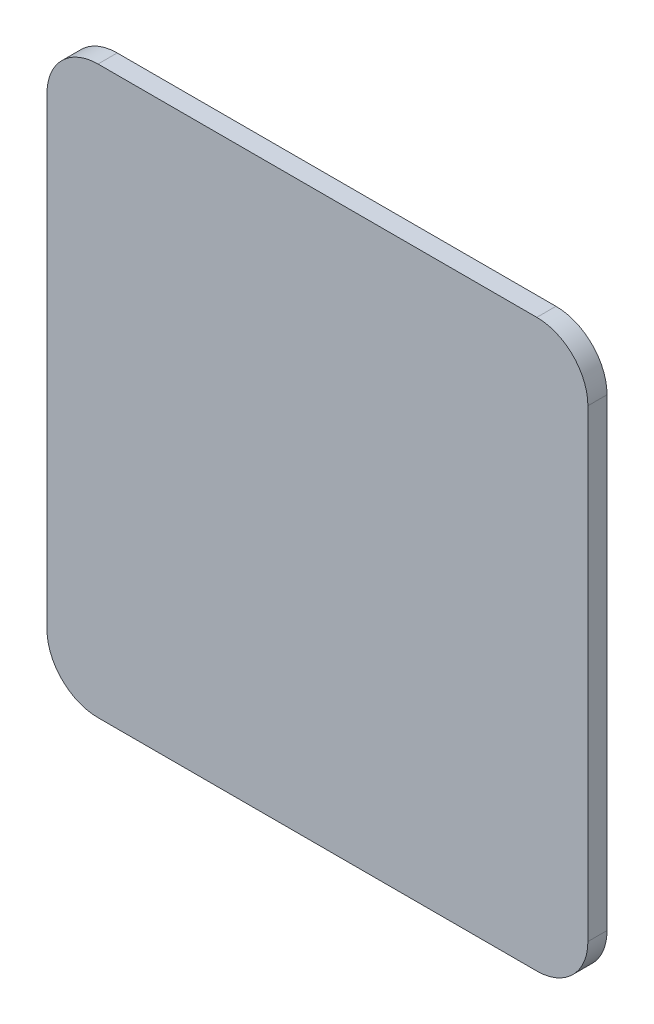
ISO-10303-21;
HEADER;
FILE_DESCRIPTION(('STEP AP214'),'2;1');
FILE_NAME('part.step','',(''),(''),'','','');
FILE_SCHEMA(('AUTOMOTIVE_DESIGN { 1 0 10303 214 1 1 1 1 }'));
ENDSEC;
DATA;
#1=APPLICATION_CONTEXT('core data for automotive mechanical design processes');
#2=APPLICATION_PROTOCOL_DEFINITION('international standard','automotive_design',2000,#1);
#3=PRODUCT_CONTEXT('',#1,'mechanical');
#4=PRODUCT('Part','Part','',(#3));
#5=PRODUCT_RELATED_PRODUCT_CATEGORY('part','',(#4));
#6=PRODUCT_DEFINITION_FORMATION('','',#4);
#7=PRODUCT_DEFINITION_CONTEXT('part definition',#1,'design');
#8=PRODUCT_DEFINITION('design','',#6,#7);
#9=PRODUCT_DEFINITION_SHAPE('','',#8);
#10=(LENGTH_UNIT() NAMED_UNIT(*) SI_UNIT(.MILLI.,.METRE.));
#11=(NAMED_UNIT(*) PLANE_ANGLE_UNIT() SI_UNIT($,.RADIAN.));
#12=(NAMED_UNIT(*) SI_UNIT($,.STERADIAN.) SOLID_ANGLE_UNIT());
#13=UNCERTAINTY_MEASURE_WITH_UNIT(LENGTH_MEASURE(1.E-05),#10,'distance_accuracy_value','');
#14=(GEOMETRIC_REPRESENTATION_CONTEXT(3) GLOBAL_UNCERTAINTY_ASSIGNED_CONTEXT((#13)) GLOBAL_UNIT_ASSIGNED_CONTEXT((#10,
#11,#12)) REPRESENTATION_CONTEXT('',''));
#15=CARTESIAN_POINT('',(0.,0.,0.));
#16=DIRECTION('',(0.,0.,1.));
#17=DIRECTION('',(1.,0.,0.));
#18=AXIS2_PLACEMENT_3D('',#15,#16,#17);
#19=CARTESIAN_POINT('',(-26.,26.,6.));
#20=DIRECTION('',(0.,0.,-1.));
#21=DIRECTION('',(-1.,0.,0.));
#22=AXIS2_PLACEMENT_3D('',#19,#20,#21);
#23=CYLINDRICAL_SURFACE('',#22,16.);
#24=CARTESIAN_POINT('',(-26.,26.,0.));
#25=DIRECTION('',(0.,0.,1.));
#26=DIRECTION('',(-1.,0.,0.));
#27=AXIS2_PLACEMENT_3D('',#24,#25,#26);
#28=CIRCLE('',#27,16.);
#29=CARTESIAN_POINT('',(-26.,9.99999999999996,0.));
#30=VERTEX_POINT('',#29);
#31=CARTESIAN_POINT('',(-9.99999999999999,26.,0.));
#32=VERTEX_POINT('',#31);
#33=EDGE_CURVE('E142',#30,#32,#28,.T.);
#34=ORIENTED_EDGE('',*,*,#33,.T.);
#35=DIRECTION('',(0.,0.,-1.));
#36=VECTOR('',#35,1.);
#37=CARTESIAN_POINT('',(-9.99999999999999,26.,6.));
#38=LINE('',#37,#36);
#39=CARTESIAN_POINT('',(-9.99999999999999,26.,6.));
#40=VERTEX_POINT('',#39);
#41=EDGE_CURVE('E11',#40,#32,#38,.T.);
#42=ORIENTED_EDGE('',*,*,#41,.F.);
#43=CARTESIAN_POINT('',(-26.,26.,6.));
#44=DIRECTION('',(0.,0.,1.));
#45=DIRECTION('',(-1.,0.,0.));
#46=AXIS2_PLACEMENT_3D('',#43,#44,#45);
#47=CIRCLE('',#46,16.);
#48=CARTESIAN_POINT('',(-26.,9.99999999999996,6.));
#49=VERTEX_POINT('',#48);
#50=EDGE_CURVE('E158',#49,#40,#47,.T.);
#51=ORIENTED_EDGE('',*,*,#50,.F.);
#52=DIRECTION('',(0.,0.,-1.));
#53=VECTOR('',#52,1.);
#54=CARTESIAN_POINT('',(-26.,9.99999999999996,6.));
#55=LINE('',#54,#53);
#56=EDGE_CURVE('E138',#49,#30,#55,.T.);
#57=ORIENTED_EDGE('',*,*,#56,.T.);
#58=EDGE_LOOP('',(#34,#42,#51,#57));
#59=FACE_BOUND('',#58,.T.);
#60=ADVANCED_FACE('F37',(#59),#23,.T.);
#61=CARTESIAN_POINT('',(-9.99999999999997,171.4,6.));
#62=DIRECTION('',(-1.,0.,0.));
#63=DIRECTION('',(0.,-1.,0.));
#64=AXIS2_PLACEMENT_3D('',#61,#62,#63);
#65=PLANE('',#64);
#66=DIRECTION('',(0.,1.,0.));
#67=VECTOR('',#66,1.);
#68=CARTESIAN_POINT('',(-9.99999999999997,171.4,0.));
#69=LINE('',#68,#67);
#70=CARTESIAN_POINT('',(-9.99999999999996,171.4,0.));
#71=VERTEX_POINT('',#70);
#72=EDGE_CURVE('E145',#32,#71,#69,.T.);
#73=ORIENTED_EDGE('',*,*,#72,.T.);
#74=DIRECTION('',(0.,0.,-1.));
#75=VECTOR('',#74,1.);
#76=CARTESIAN_POINT('',(-9.99999999999996,171.4,6.));
#77=LINE('',#76,#75);
#78=CARTESIAN_POINT('',(-9.99999999999996,171.4,6.));
#79=VERTEX_POINT('',#78);
#80=EDGE_CURVE('E45',#79,#71,#77,.T.);
#81=ORIENTED_EDGE('',*,*,#80,.F.);
#82=DIRECTION('',(0.,1.,0.));
#83=VECTOR('',#82,1.);
#84=CARTESIAN_POINT('',(-9.99999999999997,171.4,6.));
#85=LINE('',#84,#83);
#86=EDGE_CURVE('E100',#40,#79,#85,.T.);
#87=ORIENTED_EDGE('',*,*,#86,.F.);
#88=ORIENTED_EDGE('',*,*,#41,.T.);
#89=EDGE_LOOP('',(#73,#81,#87,#88));
#90=FACE_BOUND('',#89,.T.);
#91=ADVANCED_FACE('F194',(#90),#65,.F.);
#92=CARTESIAN_POINT('',(-26.,171.4,6.));
#93=DIRECTION('',(0.,0.,-1.));
#94=DIRECTION('',(-1.,0.,0.));
#95=AXIS2_PLACEMENT_3D('',#92,#93,#94);
#96=CYLINDRICAL_SURFACE('',#95,16.);
#97=CARTESIAN_POINT('',(-26.,171.4,0.));
#98=DIRECTION('',(0.,0.,1.));
#99=DIRECTION('',(-1.,0.,0.));
#100=AXIS2_PLACEMENT_3D('',#97,#98,#99);
#101=CIRCLE('',#100,16.);
#102=CARTESIAN_POINT('',(-26.,187.4,0.));
#103=VERTEX_POINT('',#102);
#104=EDGE_CURVE('E147',#71,#103,#101,.T.);
#105=ORIENTED_EDGE('',*,*,#104,.T.);
#106=DIRECTION('',(0.,0.,-1.));
#107=VECTOR('',#106,1.);
#108=CARTESIAN_POINT('',(-26.,187.4,6.));
#109=LINE('',#108,#107);
#110=CARTESIAN_POINT('',(-26.,187.4,6.));
#111=VERTEX_POINT('',#110);
#112=EDGE_CURVE('E166',#111,#103,#109,.T.);
#113=ORIENTED_EDGE('',*,*,#112,.F.);
#114=CARTESIAN_POINT('',(-26.,171.4,6.));
#115=DIRECTION('',(0.,0.,1.));
#116=DIRECTION('',(-1.,0.,0.));
#117=AXIS2_PLACEMENT_3D('',#114,#115,#116);
#118=CIRCLE('',#117,16.);
#119=EDGE_CURVE('E174',#79,#111,#118,.T.);
#120=ORIENTED_EDGE('',*,*,#119,.F.);
#121=ORIENTED_EDGE('',*,*,#80,.T.);
#122=EDGE_LOOP('',(#105,#113,#120,#121));
#123=FACE_BOUND('',#122,.T.);
#124=ADVANCED_FACE('F172',(#123),#96,.T.);
#125=CARTESIAN_POINT('',(-163.5,187.4,6.));
#126=DIRECTION('',(0.,-1.,0.));
#127=DIRECTION('',(0.,0.,-1.));
#128=AXIS2_PLACEMENT_3D('',#125,#126,#127);
#129=PLANE('',#128);
#130=DIRECTION('',(-1.,0.,0.));
#131=VECTOR('',#130,1.);
#132=CARTESIAN_POINT('',(-163.5,187.4,0.));
#133=LINE('',#132,#131);
#134=CARTESIAN_POINT('',(-163.5,187.4,0.));
#135=VERTEX_POINT('',#134);
#136=EDGE_CURVE('E149',#103,#135,#133,.T.);
#137=ORIENTED_EDGE('',*,*,#136,.T.);
#138=DIRECTION('',(0.,0.,-1.));
#139=VECTOR('',#138,1.);
#140=CARTESIAN_POINT('',(-163.5,187.4,6.));
#141=LINE('',#140,#139);
#142=CARTESIAN_POINT('',(-163.5,187.4,6.));
#143=VERTEX_POINT('',#142);
#144=EDGE_CURVE('E163',#143,#135,#141,.T.);
#145=ORIENTED_EDGE('',*,*,#144,.F.);
#146=DIRECTION('',(-1.,0.,0.));
#147=VECTOR('',#146,1.);
#148=CARTESIAN_POINT('',(-163.5,187.4,6.));
#149=LINE('',#148,#147);
#150=EDGE_CURVE('E186',#111,#143,#149,.T.);
#151=ORIENTED_EDGE('',*,*,#150,.F.);
#152=ORIENTED_EDGE('',*,*,#112,.T.);
#153=EDGE_LOOP('',(#137,#145,#151,#152));
#154=FACE_BOUND('',#153,.T.);
#155=ADVANCED_FACE('F182',(#154),#129,.F.);
#156=CARTESIAN_POINT('',(-163.5,171.4,6.));
#157=DIRECTION('',(0.,0.,-1.));
#158=DIRECTION('',(-1.,0.,0.));
#159=AXIS2_PLACEMENT_3D('',#156,#157,#158);
#160=CYLINDRICAL_SURFACE('',#159,16.);
#161=CARTESIAN_POINT('',(-163.5,171.4,0.));
#162=DIRECTION('',(0.,0.,1.));
#163=DIRECTION('',(-1.,0.,0.));
#164=AXIS2_PLACEMENT_3D('',#161,#162,#163);
#165=CIRCLE('',#164,16.);
#166=CARTESIAN_POINT('',(-179.5,171.4,0.));
#167=VERTEX_POINT('',#166);
#168=EDGE_CURVE('E151',#135,#167,#165,.T.);
#169=ORIENTED_EDGE('',*,*,#168,.T.);
#170=DIRECTION('',(0.,0.,-1.));
#171=VECTOR('',#170,1.);
#172=CARTESIAN_POINT('',(-179.5,171.4,6.));
#173=LINE('',#172,#171);
#174=CARTESIAN_POINT('',(-179.5,171.4,6.));
#175=VERTEX_POINT('',#174);
#176=EDGE_CURVE('E130',#175,#167,#173,.T.);
#177=ORIENTED_EDGE('',*,*,#176,.F.);
#178=CARTESIAN_POINT('',(-163.5,171.4,6.));
#179=DIRECTION('',(0.,0.,1.));
#180=DIRECTION('',(-1.,0.,0.));
#181=AXIS2_PLACEMENT_3D('',#178,#179,#180);
#182=CIRCLE('',#181,16.);
#183=EDGE_CURVE('E119',#143,#175,#182,.T.);
#184=ORIENTED_EDGE('',*,*,#183,.F.);
#185=ORIENTED_EDGE('',*,*,#144,.T.);
#186=EDGE_LOOP('',(#169,#177,#184,#185));
#187=FACE_BOUND('',#186,.T.);
#188=ADVANCED_FACE('F185',(#187),#160,.T.);
#189=CARTESIAN_POINT('',(-179.5,25.9999999999999,6.));
#190=DIRECTION('',(1.,0.,0.));
#191=DIRECTION('',(0.,0.,-1.));
#192=AXIS2_PLACEMENT_3D('',#189,#190,#191);
#193=PLANE('',#192);
#194=DIRECTION('',(0.,-1.,0.));
#195=VECTOR('',#194,1.);
#196=CARTESIAN_POINT('',(-179.5,25.9999999999999,0.));
#197=LINE('',#196,#195);
#198=CARTESIAN_POINT('',(-179.5,25.9999999999999,0.));
#199=VERTEX_POINT('',#198);
#200=EDGE_CURVE('E128',#167,#199,#197,.T.);
#201=ORIENTED_EDGE('',*,*,#200,.T.);
#202=DIRECTION('',(0.,0.,-1.));
#203=VECTOR('',#202,1.);
#204=CARTESIAN_POINT('',(-179.5,25.9999999999999,6.));
#205=LINE('',#204,#203);
#206=CARTESIAN_POINT('',(-179.5,25.9999999999999,6.));
#207=VERTEX_POINT('',#206);
#208=EDGE_CURVE('E125',#207,#199,#205,.T.);
#209=ORIENTED_EDGE('',*,*,#208,.F.);
#210=DIRECTION('',(0.,-1.,0.));
#211=VECTOR('',#210,1.);
#212=CARTESIAN_POINT('',(-179.5,25.9999999999999,6.));
#213=LINE('',#212,#211);
#214=EDGE_CURVE('E113',#175,#207,#213,.T.);
#215=ORIENTED_EDGE('',*,*,#214,.F.);
#216=ORIENTED_EDGE('',*,*,#176,.T.);
#217=EDGE_LOOP('',(#201,#209,#215,#216));
#218=FACE_BOUND('',#217,.T.);
#219=ADVANCED_FACE('F126',(#218),#193,.F.);
#220=CARTESIAN_POINT('',(-163.5,25.9999999999999,6.));
#221=DIRECTION('',(0.,0.,-1.));
#222=DIRECTION('',(-1.,0.,0.));
#223=AXIS2_PLACEMENT_3D('',#220,#221,#222);
#224=CYLINDRICAL_SURFACE('',#223,16.);
#225=CARTESIAN_POINT('',(-163.5,25.9999999999999,0.));
#226=DIRECTION('',(0.,0.,1.));
#227=DIRECTION('',(-1.,0.,0.));
#228=AXIS2_PLACEMENT_3D('',#225,#226,#227);
#229=CIRCLE('',#228,16.);
#230=CARTESIAN_POINT('',(-163.5,9.99999999999995,0.));
#231=VERTEX_POINT('',#230);
#232=EDGE_CURVE('E86',#199,#231,#229,.T.);
#233=ORIENTED_EDGE('',*,*,#232,.T.);
#234=DIRECTION('',(0.,0.,-1.));
#235=VECTOR('',#234,1.);
#236=CARTESIAN_POINT('',(-163.5,9.99999999999995,6.));
#237=LINE('',#236,#235);
#238=CARTESIAN_POINT('',(-163.5,9.99999999999995,6.));
#239=VERTEX_POINT('',#238);
#240=EDGE_CURVE('E131',#239,#231,#237,.T.);
#241=ORIENTED_EDGE('',*,*,#240,.F.);
#242=CARTESIAN_POINT('',(-163.5,25.9999999999999,6.));
#243=DIRECTION('',(0.,0.,1.));
#244=DIRECTION('',(-1.,0.,0.));
#245=AXIS2_PLACEMENT_3D('',#242,#243,#244);
#246=CIRCLE('',#245,16.);
#247=EDGE_CURVE('E117',#207,#239,#246,.T.);
#248=ORIENTED_EDGE('',*,*,#247,.F.);
#249=ORIENTED_EDGE('',*,*,#208,.T.);
#250=EDGE_LOOP('',(#233,#241,#248,#249));
#251=FACE_BOUND('',#250,.T.);
#252=ADVANCED_FACE('F133',(#251),#224,.T.);
#253=CARTESIAN_POINT('',(-26.,9.99999999999996,6.));
#254=DIRECTION('',(0.,1.,0.));
#255=DIRECTION('',(-1.,0.,0.));
#256=AXIS2_PLACEMENT_3D('',#253,#254,#255);
#257=PLANE('',#256);
#258=DIRECTION('',(1.,0.,0.));
#259=VECTOR('',#258,1.);
#260=CARTESIAN_POINT('',(-26.,9.99999999999996,0.));
#261=LINE('',#260,#259);
#262=EDGE_CURVE('E92',#231,#30,#261,.T.);
#263=ORIENTED_EDGE('',*,*,#262,.T.);
#264=ORIENTED_EDGE('',*,*,#56,.F.);
#265=DIRECTION('',(1.,0.,0.));
#266=VECTOR('',#265,1.);
#267=CARTESIAN_POINT('',(-26.,9.99999999999996,6.));
#268=LINE('',#267,#266);
#269=EDGE_CURVE('E53',#239,#49,#268,.T.);
#270=ORIENTED_EDGE('',*,*,#269,.F.);
#271=ORIENTED_EDGE('',*,*,#240,.T.);
#272=EDGE_LOOP('',(#263,#264,#270,#271));
#273=FACE_BOUND('',#272,.T.);
#274=ADVANCED_FACE('F210',(#273),#257,.F.);
#275=CARTESIAN_POINT('',(-26.,26.,6.));
#276=DIRECTION('',(0.,0.,-1.));
#277=DIRECTION('',(-1.,0.,0.));
#278=AXIS2_PLACEMENT_3D('',#275,#276,#277);
#279=PLANE('',#278);
#280=ORIENTED_EDGE('',*,*,#50,.T.);
#281=ORIENTED_EDGE('',*,*,#86,.T.);
#282=ORIENTED_EDGE('',*,*,#119,.T.);
#283=ORIENTED_EDGE('',*,*,#150,.T.);
#284=ORIENTED_EDGE('',*,*,#183,.T.);
#285=ORIENTED_EDGE('',*,*,#214,.T.);
#286=ORIENTED_EDGE('',*,*,#247,.T.);
#287=ORIENTED_EDGE('',*,*,#269,.T.);
#288=EDGE_LOOP('',(#280,#281,#282,#283,#284,#285,#286,#287));
#289=FACE_BOUND('',#288,.T.);
#290=ADVANCED_FACE('F115',(#289),#279,.F.);
#291=CARTESIAN_POINT('',(-26.,26.,0.));
#292=DIRECTION('',(0.,0.,-1.));
#293=DIRECTION('',(-1.,0.,0.));
#294=AXIS2_PLACEMENT_3D('',#291,#292,#293);
#295=PLANE('',#294);
#296=ORIENTED_EDGE('',*,*,#33,.F.);
#297=ORIENTED_EDGE('',*,*,#262,.F.);
#298=ORIENTED_EDGE('',*,*,#232,.F.);
#299=ORIENTED_EDGE('',*,*,#200,.F.);
#300=ORIENTED_EDGE('',*,*,#168,.F.);
#301=ORIENTED_EDGE('',*,*,#136,.F.);
#302=ORIENTED_EDGE('',*,*,#104,.F.);
#303=ORIENTED_EDGE('',*,*,#72,.F.);
#304=EDGE_LOOP('',(#296,#297,#298,#299,#300,#301,#302,#303));
#305=FACE_BOUND('',#304,.T.);
#306=ADVANCED_FACE('F178',(#305),#295,.T.);
#307=CLOSED_SHELL('',(#60,#91,#124,#155,#188,#219,#252,#274,#290,#306));
#308=MANIFOLD_SOLID_BREP('B2',#307);
#309=ADVANCED_BREP_SHAPE_REPRESENTATION('',(#18,#308),#14);
#310=SHAPE_DEFINITION_REPRESENTATION(#9,#309);
ENDSEC;
END-ISO-10303-21;
